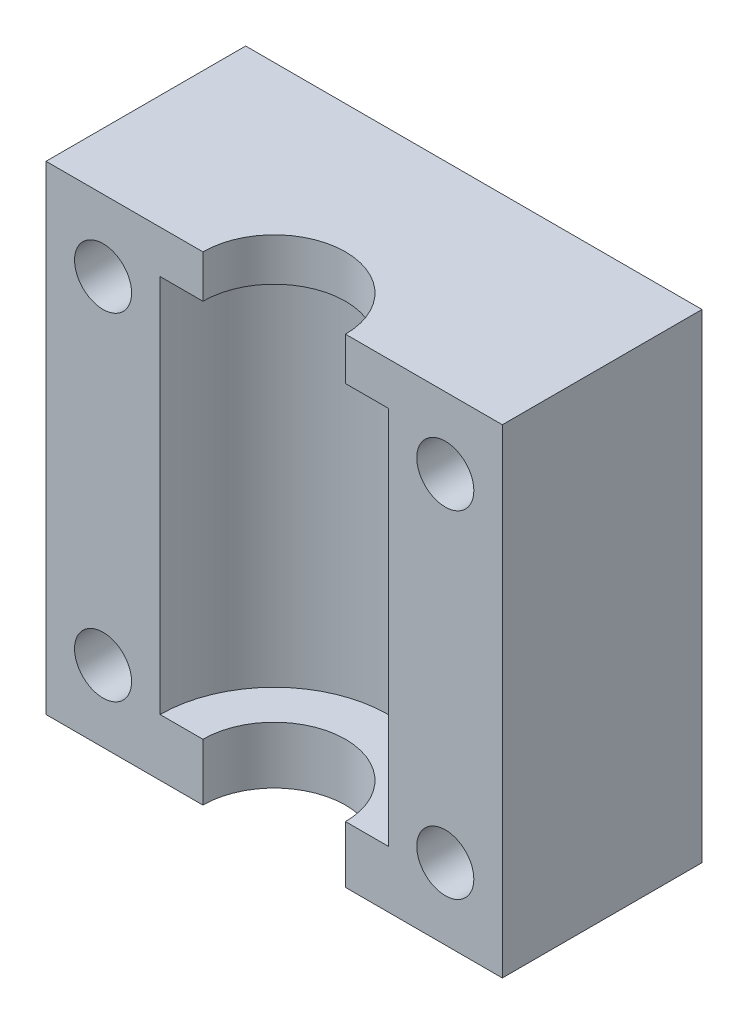
ISO-10303-21;
HEADER;
FILE_DESCRIPTION(('STEP AP214'),'2;1');
FILE_NAME('part.step','',(''),(''),'','','');
FILE_SCHEMA(('AUTOMOTIVE_DESIGN { 1 0 10303 214 1 1 1 1 }'));
ENDSEC;
DATA;
#1=APPLICATION_CONTEXT('core data for automotive mechanical design processes');
#2=APPLICATION_PROTOCOL_DEFINITION('international standard','automotive_design',2000,#1);
#3=PRODUCT_CONTEXT('',#1,'mechanical');
#4=PRODUCT('Part','Part','',(#3));
#5=PRODUCT_RELATED_PRODUCT_CATEGORY('part','',(#4));
#6=PRODUCT_DEFINITION_FORMATION('','',#4);
#7=PRODUCT_DEFINITION_CONTEXT('part definition',#1,'design');
#8=PRODUCT_DEFINITION('design','',#6,#7);
#9=PRODUCT_DEFINITION_SHAPE('','',#8);
#10=(LENGTH_UNIT() NAMED_UNIT(*) SI_UNIT(.MILLI.,.METRE.));
#11=(NAMED_UNIT(*) PLANE_ANGLE_UNIT() SI_UNIT($,.RADIAN.));
#12=(NAMED_UNIT(*) SI_UNIT($,.STERADIAN.) SOLID_ANGLE_UNIT());
#13=UNCERTAINTY_MEASURE_WITH_UNIT(LENGTH_MEASURE(1.E-05),#10,'distance_accuracy_value','');
#14=(GEOMETRIC_REPRESENTATION_CONTEXT(3) GLOBAL_UNCERTAINTY_ASSIGNED_CONTEXT((#13)) GLOBAL_UNIT_ASSIGNED_CONTEXT((#10,
#11,#12)) REPRESENTATION_CONTEXT('',''));
#15=CARTESIAN_POINT('',(0.,0.,0.));
#16=DIRECTION('',(0.,0.,1.));
#17=DIRECTION('',(1.,0.,0.));
#18=AXIS2_PLACEMENT_3D('',#15,#16,#17);
#19=CARTESIAN_POINT('',(0.,0.,0.));
#20=DIRECTION('',(0.,1.,0.));
#21=DIRECTION('',(-1.,0.,0.));
#22=AXIS2_PLACEMENT_3D('',#19,#20,#21);
#23=CYLINDRICAL_SURFACE('',#22,5.);
#24=CARTESIAN_POINT('',(0.,-30.6,0.));
#25=DIRECTION('',(0.,1.,0.));
#26=DIRECTION('',(-1.,0.,0.));
#27=AXIS2_PLACEMENT_3D('',#24,#25,#26);
#28=CIRCLE('',#27,5.);
#29=CARTESIAN_POINT('',(5.,-30.6,0.));
#30=VERTEX_POINT('',#29);
#31=CARTESIAN_POINT('',(-5.,-30.6,0.));
#32=VERTEX_POINT('',#31);
#33=EDGE_CURVE('E12',#30,#32,#28,.T.);
#34=ORIENTED_EDGE('',*,*,#33,.F.);
#35=DIRECTION('',(0.,1.,0.));
#36=VECTOR('',#35,1.);
#37=CARTESIAN_POINT('',(5.,-26.6,0.));
#38=LINE('',#37,#36);
#39=CARTESIAN_POINT('',(5.,-26.6,0.));
#40=VERTEX_POINT('',#39);
#41=EDGE_CURVE('E192',#30,#40,#38,.T.);
#42=ORIENTED_EDGE('',*,*,#41,.T.);
#43=CARTESIAN_POINT('',(0.,-26.6,0.));
#44=DIRECTION('',(0.,1.,0.));
#45=DIRECTION('',(-1.,0.,0.));
#46=AXIS2_PLACEMENT_3D('',#43,#44,#45);
#47=CIRCLE('',#46,5.);
#48=CARTESIAN_POINT('',(-5.,-26.6,0.));
#49=VERTEX_POINT('',#48);
#50=EDGE_CURVE('E209',#40,#49,#47,.T.);
#51=ORIENTED_EDGE('',*,*,#50,.T.);
#52=DIRECTION('',(0.,1.,0.));
#53=VECTOR('',#52,1.);
#54=CARTESIAN_POINT('',(-5.,-26.6,0.));
#55=LINE('',#54,#53);
#56=EDGE_CURVE('E143',#32,#49,#55,.T.);
#57=ORIENTED_EDGE('',*,*,#56,.F.);
#58=EDGE_LOOP('',(#34,#42,#51,#57));
#59=FACE_BOUND('',#58,.T.);
#60=ADVANCED_FACE('F57',(#59),#23,.F.);
#61=CARTESIAN_POINT('',(5.,-30.6,0.));
#62=DIRECTION('',(0.,-1.,0.));
#63=DIRECTION('',(1.,0.,0.));
#64=AXIS2_PLACEMENT_3D('',#61,#62,#63);
#65=PLANE('',#64);
#66=DIRECTION('',(1.,0.,0.));
#67=VECTOR('',#66,1.);
#68=CARTESIAN_POINT('',(0.,-30.6,-14.));
#69=LINE('',#68,#67);
#70=CARTESIAN_POINT('',(-16.,-30.6,-14.));
#71=VERTEX_POINT('',#70);
#72=CARTESIAN_POINT('',(16.,-30.6,-14.));
#73=VERTEX_POINT('',#72);
#74=EDGE_CURVE('E133',#71,#73,#69,.T.);
#75=ORIENTED_EDGE('',*,*,#74,.T.);
#76=DIRECTION('',(0.,0.,1.));
#77=VECTOR('',#76,1.);
#78=CARTESIAN_POINT('',(16.,-30.6,-14.));
#79=LINE('',#78,#77);
#80=CARTESIAN_POINT('',(16.,-30.6,0.));
#81=VERTEX_POINT('',#80);
#82=EDGE_CURVE('E135',#73,#81,#79,.T.);
#83=ORIENTED_EDGE('',*,*,#82,.T.);
#84=DIRECTION('',(-1.,0.,0.));
#85=VECTOR('',#84,1.);
#86=CARTESIAN_POINT('',(5.,-30.6,0.));
#87=LINE('',#86,#85);
#88=EDGE_CURVE('E73',#81,#30,#87,.T.);
#89=ORIENTED_EDGE('',*,*,#88,.T.);
#90=ORIENTED_EDGE('',*,*,#33,.T.);
#91=DIRECTION('',(1.,0.,0.));
#92=VECTOR('',#91,1.);
#93=CARTESIAN_POINT('',(-5.,-30.6,0.));
#94=LINE('',#93,#92);
#95=CARTESIAN_POINT('',(-16.,-30.6,0.));
#96=VERTEX_POINT('',#95);
#97=EDGE_CURVE('E190',#96,#32,#94,.T.);
#98=ORIENTED_EDGE('',*,*,#97,.F.);
#99=DIRECTION('',(0.,0.,1.));
#100=VECTOR('',#99,1.);
#101=CARTESIAN_POINT('',(-16.,-30.6,-14.));
#102=LINE('',#101,#100);
#103=EDGE_CURVE('E138',#71,#96,#102,.T.);
#104=ORIENTED_EDGE('',*,*,#103,.F.);
#105=EDGE_LOOP('',(#75,#83,#89,#90,#98,#104));
#106=FACE_BOUND('',#105,.T.);
#107=ADVANCED_FACE('F59',(#106),#65,.T.);
#108=CARTESIAN_POINT('',(5.,3.,0.));
#109=DIRECTION('',(0.,1.,0.));
#110=DIRECTION('',(-1.,0.,0.));
#111=AXIS2_PLACEMENT_3D('',#108,#109,#110);
#112=PLANE('',#111);
#113=DIRECTION('',(0.,0.,1.));
#114=VECTOR('',#113,1.);
#115=CARTESIAN_POINT('',(16.,3.00000000000001,-14.));
#116=LINE('',#115,#114);
#117=CARTESIAN_POINT('',(16.,3.00000000000001,-14.));
#118=VERTEX_POINT('',#117);
#119=CARTESIAN_POINT('',(16.,3.00000000000001,0.));
#120=VERTEX_POINT('',#119);
#121=EDGE_CURVE('E153',#118,#120,#116,.T.);
#122=ORIENTED_EDGE('',*,*,#121,.F.);
#123=DIRECTION('',(1.,0.,0.));
#124=VECTOR('',#123,1.);
#125=CARTESIAN_POINT('',(0.,3.,-14.));
#126=LINE('',#125,#124);
#127=CARTESIAN_POINT('',(-16.,3.,-14.));
#128=VERTEX_POINT('',#127);
#129=EDGE_CURVE('E144',#128,#118,#126,.T.);
#130=ORIENTED_EDGE('',*,*,#129,.F.);
#131=DIRECTION('',(0.,0.,1.));
#132=VECTOR('',#131,1.);
#133=CARTESIAN_POINT('',(-16.,3.,-14.));
#134=LINE('',#133,#132);
#135=CARTESIAN_POINT('',(-16.,3.,0.));
#136=VERTEX_POINT('',#135);
#137=EDGE_CURVE('E167',#128,#136,#134,.T.);
#138=ORIENTED_EDGE('',*,*,#137,.T.);
#139=DIRECTION('',(-1.,0.,0.));
#140=VECTOR('',#139,1.);
#141=CARTESIAN_POINT('',(-5.,3.,0.));
#142=LINE('',#141,#140);
#143=CARTESIAN_POINT('',(-5.,3.,0.));
#144=VERTEX_POINT('',#143);
#145=EDGE_CURVE('E188',#144,#136,#142,.T.);
#146=ORIENTED_EDGE('',*,*,#145,.F.);
#147=CARTESIAN_POINT('',(0.,3.,0.));
#148=DIRECTION('',(0.,1.,0.));
#149=DIRECTION('',(-1.,0.,0.));
#150=AXIS2_PLACEMENT_3D('',#147,#148,#149);
#151=CIRCLE('',#150,5.);
#152=CARTESIAN_POINT('',(5.,3.,0.));
#153=VERTEX_POINT('',#152);
#154=EDGE_CURVE('E66',#153,#144,#151,.T.);
#155=ORIENTED_EDGE('',*,*,#154,.F.);
#156=DIRECTION('',(1.,0.,0.));
#157=VECTOR('',#156,1.);
#158=CARTESIAN_POINT('',(5.,3.,0.));
#159=LINE('',#158,#157);
#160=EDGE_CURVE('E206',#153,#120,#159,.T.);
#161=ORIENTED_EDGE('',*,*,#160,.T.);
#162=EDGE_LOOP('',(#122,#130,#138,#146,#155,#161));
#163=FACE_BOUND('',#162,.T.);
#164=ADVANCED_FACE('F250',(#163),#112,.T.);
#165=CARTESIAN_POINT('',(0.,0.,0.));
#166=DIRECTION('',(0.,1.,0.));
#167=DIRECTION('',(-1.,0.,0.));
#168=AXIS2_PLACEMENT_3D('',#165,#166,#167);
#169=CYLINDRICAL_SURFACE('',#168,5.);
#170=CARTESIAN_POINT('',(0.,0.,0.));
#171=DIRECTION('',(0.,1.,0.));
#172=DIRECTION('',(-1.,0.,0.));
#173=AXIS2_PLACEMENT_3D('',#170,#171,#172);
#174=CIRCLE('',#173,5.);
#175=CARTESIAN_POINT('',(5.,0.,0.));
#176=VERTEX_POINT('',#175);
#177=CARTESIAN_POINT('',(-5.,0.,0.));
#178=VERTEX_POINT('',#177);
#179=EDGE_CURVE('E215',#176,#178,#174,.T.);
#180=ORIENTED_EDGE('',*,*,#179,.F.);
#181=DIRECTION('',(0.,1.,0.));
#182=VECTOR('',#181,1.);
#183=CARTESIAN_POINT('',(5.,0.,0.));
#184=LINE('',#183,#182);
#185=EDGE_CURVE('E204',#176,#153,#184,.T.);
#186=ORIENTED_EDGE('',*,*,#185,.T.);
#187=ORIENTED_EDGE('',*,*,#154,.T.);
#188=DIRECTION('',(0.,1.,0.));
#189=VECTOR('',#188,1.);
#190=CARTESIAN_POINT('',(-5.,0.,0.));
#191=LINE('',#190,#189);
#192=EDGE_CURVE('E185',#178,#144,#191,.T.);
#193=ORIENTED_EDGE('',*,*,#192,.F.);
#194=EDGE_LOOP('',(#180,#186,#187,#193));
#195=FACE_BOUND('',#194,.T.);
#196=ADVANCED_FACE('F266',(#195),#169,.F.);
#197=CARTESIAN_POINT('',(8.,0.,0.));
#198=DIRECTION('',(0.,-1.,0.));
#199=DIRECTION('',(1.,0.,0.));
#200=AXIS2_PLACEMENT_3D('',#197,#198,#199);
#201=PLANE('',#200);
#202=CARTESIAN_POINT('',(0.,0.,0.));
#203=DIRECTION('',(0.,1.,0.));
#204=DIRECTION('',(-1.,0.,0.));
#205=AXIS2_PLACEMENT_3D('',#202,#203,#204);
#206=CIRCLE('',#205,8.);
#207=CARTESIAN_POINT('',(8.,0.,0.));
#208=VERTEX_POINT('',#207);
#209=CARTESIAN_POINT('',(-8.,0.,0.));
#210=VERTEX_POINT('',#209);
#211=EDGE_CURVE('E213',#208,#210,#206,.T.);
#212=ORIENTED_EDGE('',*,*,#211,.F.);
#213=DIRECTION('',(-1.,0.,0.));
#214=VECTOR('',#213,1.);
#215=CARTESIAN_POINT('',(8.,0.,0.));
#216=LINE('',#215,#214);
#217=EDGE_CURVE('E201',#208,#176,#216,.T.);
#218=ORIENTED_EDGE('',*,*,#217,.T.);
#219=ORIENTED_EDGE('',*,*,#179,.T.);
#220=DIRECTION('',(1.,0.,0.));
#221=VECTOR('',#220,1.);
#222=CARTESIAN_POINT('',(-8.,0.,0.));
#223=LINE('',#222,#221);
#224=EDGE_CURVE('E182',#210,#178,#223,.T.);
#225=ORIENTED_EDGE('',*,*,#224,.F.);
#226=EDGE_LOOP('',(#212,#218,#219,#225));
#227=FACE_BOUND('',#226,.T.);
#228=ADVANCED_FACE('F262',(#227),#201,.T.);
#229=CARTESIAN_POINT('',(0.,0.,0.));
#230=DIRECTION('',(0.,1.,0.));
#231=DIRECTION('',(-1.,0.,0.));
#232=AXIS2_PLACEMENT_3D('',#229,#230,#231);
#233=CYLINDRICAL_SURFACE('',#232,8.);
#234=CARTESIAN_POINT('',(0.,-26.6,0.));
#235=DIRECTION('',(0.,1.,0.));
#236=DIRECTION('',(-1.,0.,0.));
#237=AXIS2_PLACEMENT_3D('',#234,#235,#236);
#238=CIRCLE('',#237,8.);
#239=CARTESIAN_POINT('',(8.,-26.6,0.));
#240=VERTEX_POINT('',#239);
#241=CARTESIAN_POINT('',(-8.,-26.6,0.));
#242=VERTEX_POINT('',#241);
#243=EDGE_CURVE('E211',#240,#242,#238,.T.);
#244=ORIENTED_EDGE('',*,*,#243,.F.);
#245=DIRECTION('',(0.,1.,0.));
#246=VECTOR('',#245,1.);
#247=CARTESIAN_POINT('',(8.,-26.6,0.));
#248=LINE('',#247,#246);
#249=EDGE_CURVE('E198',#240,#208,#248,.T.);
#250=ORIENTED_EDGE('',*,*,#249,.T.);
#251=ORIENTED_EDGE('',*,*,#211,.T.);
#252=DIRECTION('',(0.,1.,0.));
#253=VECTOR('',#252,1.);
#254=CARTESIAN_POINT('',(-8.,-26.6,0.));
#255=LINE('',#254,#253);
#256=EDGE_CURVE('E179',#242,#210,#255,.T.);
#257=ORIENTED_EDGE('',*,*,#256,.F.);
#258=EDGE_LOOP('',(#244,#250,#251,#257));
#259=FACE_BOUND('',#258,.T.);
#260=ADVANCED_FACE('F258',(#259),#233,.F.);
#261=CARTESIAN_POINT('',(8.,-26.6,0.));
#262=DIRECTION('',(0.,1.,0.));
#263=DIRECTION('',(-1.,0.,0.));
#264=AXIS2_PLACEMENT_3D('',#261,#262,#263);
#265=PLANE('',#264);
#266=DIRECTION('',(1.,0.,0.));
#267=VECTOR('',#266,1.);
#268=CARTESIAN_POINT('',(8.,-26.6,0.));
#269=LINE('',#268,#267);
#270=EDGE_CURVE('E195',#40,#240,#269,.T.);
#271=ORIENTED_EDGE('',*,*,#270,.T.);
#272=ORIENTED_EDGE('',*,*,#243,.T.);
#273=DIRECTION('',(-1.,0.,0.));
#274=VECTOR('',#273,1.);
#275=CARTESIAN_POINT('',(-8.,-26.6,0.));
#276=LINE('',#275,#274);
#277=EDGE_CURVE('E176',#49,#242,#276,.T.);
#278=ORIENTED_EDGE('',*,*,#277,.F.);
#279=ORIENTED_EDGE('',*,*,#50,.F.);
#280=EDGE_LOOP('',(#271,#272,#278,#279));
#281=FACE_BOUND('',#280,.T.);
#282=ADVANCED_FACE('F255',(#281),#265,.T.);
#283=CARTESIAN_POINT('',(0.,0.,0.));
#284=DIRECTION('',(0.,0.,1.));
#285=DIRECTION('',(1.,0.,0.));
#286=AXIS2_PLACEMENT_3D('',#283,#284,#285);
#287=PLANE('',#286);
#288=CARTESIAN_POINT('',(12.,-2.,0.));
#289=DIRECTION('',(0.,0.,1.));
#290=DIRECTION('',(1.,0.,0.));
#291=AXIS2_PLACEMENT_3D('',#288,#289,#290);
#292=CIRCLE('',#291,2.);
#293=CARTESIAN_POINT('',(14.,-2.,0.));
#294=VERTEX_POINT('',#293);
#295=EDGE_CURVE('E318',#294,#294,#292,.T.);
#296=ORIENTED_EDGE('',*,*,#295,.F.);
#297=EDGE_LOOP('',(#296));
#298=FACE_BOUND('',#297,.T.);
#299=CARTESIAN_POINT('',(12.,-25.6,0.));
#300=DIRECTION('',(0.,0.,1.));
#301=DIRECTION('',(1.,0.,0.));
#302=AXIS2_PLACEMENT_3D('',#299,#300,#301);
#303=CIRCLE('',#302,2.);
#304=CARTESIAN_POINT('',(14.,-25.6,0.));
#305=VERTEX_POINT('',#304);
#306=EDGE_CURVE('E323',#305,#305,#303,.T.);
#307=ORIENTED_EDGE('',*,*,#306,.F.);
#308=EDGE_LOOP('',(#307));
#309=FACE_BOUND('',#308,.T.);
#310=ORIENTED_EDGE('',*,*,#41,.F.);
#311=ORIENTED_EDGE('',*,*,#88,.F.);
#312=DIRECTION('',(0.,1.,0.));
#313=VECTOR('',#312,1.);
#314=CARTESIAN_POINT('',(16.,3.00000000000001,0.));
#315=LINE('',#314,#313);
#316=EDGE_CURVE('E152',#81,#120,#315,.T.);
#317=ORIENTED_EDGE('',*,*,#316,.T.);
#318=ORIENTED_EDGE('',*,*,#160,.F.);
#319=ORIENTED_EDGE('',*,*,#185,.F.);
#320=ORIENTED_EDGE('',*,*,#217,.F.);
#321=ORIENTED_EDGE('',*,*,#249,.F.);
#322=ORIENTED_EDGE('',*,*,#270,.F.);
#323=EDGE_LOOP('',(#310,#311,#317,#318,#319,#320,#321,#322));
#324=FACE_BOUND('',#323,.T.);
#325=ADVANCED_FACE('F253',(#298,#309,#324),#287,.T.);
#326=CARTESIAN_POINT('',(0.,0.,0.));
#327=DIRECTION('',(0.,0.,-1.));
#328=DIRECTION('',(-1.,0.,0.));
#329=AXIS2_PLACEMENT_3D('',#326,#327,#328);
#330=PLANE('',#329);
#331=CARTESIAN_POINT('',(-12.,-25.6,0.));
#332=DIRECTION('',(0.,0.,1.));
#333=DIRECTION('',(1.,0.,0.));
#334=AXIS2_PLACEMENT_3D('',#331,#332,#333);
#335=CIRCLE('',#334,2.);
#336=CARTESIAN_POINT('',(-10.,-25.6,0.));
#337=VERTEX_POINT('',#336);
#338=EDGE_CURVE('E319',#337,#337,#335,.T.);
#339=ORIENTED_EDGE('',*,*,#338,.F.);
#340=EDGE_LOOP('',(#339));
#341=FACE_BOUND('',#340,.T.);
#342=CARTESIAN_POINT('',(-12.,-2.,0.));
#343=DIRECTION('',(0.,0.,1.));
#344=DIRECTION('',(1.,0.,0.));
#345=AXIS2_PLACEMENT_3D('',#342,#343,#344);
#346=CIRCLE('',#345,2.);
#347=CARTESIAN_POINT('',(-10.,-2.,0.));
#348=VERTEX_POINT('',#347);
#349=EDGE_CURVE('E160',#348,#348,#346,.T.);
#350=ORIENTED_EDGE('',*,*,#349,.F.);
#351=EDGE_LOOP('',(#350));
#352=FACE_BOUND('',#351,.T.);
#353=ORIENTED_EDGE('',*,*,#277,.T.);
#354=ORIENTED_EDGE('',*,*,#256,.T.);
#355=ORIENTED_EDGE('',*,*,#224,.T.);
#356=ORIENTED_EDGE('',*,*,#192,.T.);
#357=ORIENTED_EDGE('',*,*,#145,.T.);
#358=DIRECTION('',(0.,-1.,0.));
#359=VECTOR('',#358,1.);
#360=CARTESIAN_POINT('',(-16.,3.,0.));
#361=LINE('',#360,#359);
#362=EDGE_CURVE('E163',#136,#96,#361,.T.);
#363=ORIENTED_EDGE('',*,*,#362,.T.);
#364=ORIENTED_EDGE('',*,*,#97,.T.);
#365=ORIENTED_EDGE('',*,*,#56,.T.);
#366=EDGE_LOOP('',(#353,#354,#355,#356,#357,#363,#364,#365));
#367=FACE_BOUND('',#366,.T.);
#368=ADVANCED_FACE('F286',(#341,#352,#367),#330,.F.);
#369=CARTESIAN_POINT('',(0.,-30.6,-14.));
#370=DIRECTION('',(0.,0.,1.));
#371=DIRECTION('',(1.,0.,0.));
#372=AXIS2_PLACEMENT_3D('',#369,#370,#371);
#373=PLANE('',#372);
#374=CARTESIAN_POINT('',(12.,-2.,-14.));
#375=DIRECTION('',(0.,0.,1.));
#376=DIRECTION('',(1.,0.,0.));
#377=AXIS2_PLACEMENT_3D('',#374,#375,#376);
#378=CIRCLE('',#377,2.);
#379=CARTESIAN_POINT('',(14.,-2.,-14.));
#380=VERTEX_POINT('',#379);
#381=EDGE_CURVE('E61',#380,#380,#378,.T.);
#382=ORIENTED_EDGE('',*,*,#381,.T.);
#383=EDGE_LOOP('',(#382));
#384=FACE_BOUND('',#383,.T.);
#385=CARTESIAN_POINT('',(-12.,-25.6,-14.));
#386=DIRECTION('',(0.,0.,1.));
#387=DIRECTION('',(1.,0.,0.));
#388=AXIS2_PLACEMENT_3D('',#385,#386,#387);
#389=CIRCLE('',#388,2.);
#390=CARTESIAN_POINT('',(-10.,-25.6,-14.));
#391=VERTEX_POINT('',#390);
#392=EDGE_CURVE('E223',#391,#391,#389,.T.);
#393=ORIENTED_EDGE('',*,*,#392,.T.);
#394=EDGE_LOOP('',(#393));
#395=FACE_BOUND('',#394,.T.);
#396=CARTESIAN_POINT('',(12.,-25.6,-14.));
#397=DIRECTION('',(0.,0.,1.));
#398=DIRECTION('',(1.,0.,0.));
#399=AXIS2_PLACEMENT_3D('',#396,#397,#398);
#400=CIRCLE('',#399,2.);
#401=CARTESIAN_POINT('',(14.,-25.6,-14.));
#402=VERTEX_POINT('',#401);
#403=EDGE_CURVE('E221',#402,#402,#400,.T.);
#404=ORIENTED_EDGE('',*,*,#403,.T.);
#405=EDGE_LOOP('',(#404));
#406=FACE_BOUND('',#405,.T.);
#407=CARTESIAN_POINT('',(-12.,-2.,-14.));
#408=DIRECTION('',(0.,0.,1.));
#409=DIRECTION('',(1.,0.,0.));
#410=AXIS2_PLACEMENT_3D('',#407,#408,#409);
#411=CIRCLE('',#410,2.);
#412=CARTESIAN_POINT('',(-10.,-2.,-14.));
#413=VERTEX_POINT('',#412);
#414=EDGE_CURVE('E218',#413,#413,#411,.T.);
#415=ORIENTED_EDGE('',*,*,#414,.T.);
#416=EDGE_LOOP('',(#415));
#417=FACE_BOUND('',#416,.T.);
#418=ORIENTED_EDGE('',*,*,#129,.T.);
#419=DIRECTION('',(0.,1.,0.));
#420=VECTOR('',#419,1.);
#421=CARTESIAN_POINT('',(16.,3.00000000000001,-14.));
#422=LINE('',#421,#420);
#423=EDGE_CURVE('E150',#73,#118,#422,.T.);
#424=ORIENTED_EDGE('',*,*,#423,.F.);
#425=ORIENTED_EDGE('',*,*,#74,.F.);
#426=DIRECTION('',(0.,-1.,0.));
#427=VECTOR('',#426,1.);
#428=CARTESIAN_POINT('',(-16.,3.,-14.));
#429=LINE('',#428,#427);
#430=EDGE_CURVE('E165',#128,#71,#429,.T.);
#431=ORIENTED_EDGE('',*,*,#430,.F.);
#432=EDGE_LOOP('',(#418,#424,#425,#431));
#433=FACE_BOUND('',#432,.T.);
#434=ADVANCED_FACE('F155',(#384,#395,#406,#417,#433),#373,.F.);
#435=CARTESIAN_POINT('',(-16.,3.,-14.));
#436=DIRECTION('',(-1.,0.,0.));
#437=DIRECTION('',(0.,-1.,0.));
#438=AXIS2_PLACEMENT_3D('',#435,#436,#437);
#439=PLANE('',#438);
#440=ORIENTED_EDGE('',*,*,#362,.F.);
#441=ORIENTED_EDGE('',*,*,#137,.F.);
#442=ORIENTED_EDGE('',*,*,#430,.T.);
#443=ORIENTED_EDGE('',*,*,#103,.T.);
#444=EDGE_LOOP('',(#440,#441,#442,#443));
#445=FACE_BOUND('',#444,.T.);
#446=ADVANCED_FACE('F285',(#445),#439,.T.);
#447=CARTESIAN_POINT('',(16.,3.00000000000001,-14.));
#448=DIRECTION('',(1.,0.,0.));
#449=DIRECTION('',(0.,1.,0.));
#450=AXIS2_PLACEMENT_3D('',#447,#448,#449);
#451=PLANE('',#450);
#452=ORIENTED_EDGE('',*,*,#316,.F.);
#453=ORIENTED_EDGE('',*,*,#82,.F.);
#454=ORIENTED_EDGE('',*,*,#423,.T.);
#455=ORIENTED_EDGE('',*,*,#121,.T.);
#456=EDGE_LOOP('',(#452,#453,#454,#455));
#457=FACE_BOUND('',#456,.T.);
#458=ADVANCED_FACE('F148',(#457),#451,.T.);
#459=CARTESIAN_POINT('',(-12.,-2.,-26.));
#460=DIRECTION('',(0.,0.,1.));
#461=DIRECTION('',(1.,0.,0.));
#462=AXIS2_PLACEMENT_3D('',#459,#460,#461);
#463=CYLINDRICAL_SURFACE('',#462,2.);
#464=ORIENTED_EDGE('',*,*,#349,.T.);
#465=EDGE_LOOP('',(#464));
#466=FACE_BOUND('',#465,.T.);
#467=ORIENTED_EDGE('',*,*,#414,.F.);
#468=EDGE_LOOP('',(#467));
#469=FACE_BOUND('',#468,.T.);
#470=ADVANCED_FACE('F306',(#466,#469),#463,.F.);
#471=CARTESIAN_POINT('',(12.,-25.6,-26.));
#472=DIRECTION('',(0.,0.,1.));
#473=DIRECTION('',(1.,0.,0.));
#474=AXIS2_PLACEMENT_3D('',#471,#472,#473);
#475=CYLINDRICAL_SURFACE('',#474,2.);
#476=ORIENTED_EDGE('',*,*,#306,.T.);
#477=EDGE_LOOP('',(#476));
#478=FACE_BOUND('',#477,.T.);
#479=ORIENTED_EDGE('',*,*,#403,.F.);
#480=EDGE_LOOP('',(#479));
#481=FACE_BOUND('',#480,.T.);
#482=ADVANCED_FACE('F239',(#478,#481),#475,.F.);
#483=CARTESIAN_POINT('',(-12.,-25.6,-26.));
#484=DIRECTION('',(0.,0.,1.));
#485=DIRECTION('',(1.,0.,0.));
#486=AXIS2_PLACEMENT_3D('',#483,#484,#485);
#487=CYLINDRICAL_SURFACE('',#486,2.);
#488=ORIENTED_EDGE('',*,*,#338,.T.);
#489=EDGE_LOOP('',(#488));
#490=FACE_BOUND('',#489,.T.);
#491=ORIENTED_EDGE('',*,*,#392,.F.);
#492=EDGE_LOOP('',(#491));
#493=FACE_BOUND('',#492,.T.);
#494=ADVANCED_FACE('F233',(#490,#493),#487,.F.);
#495=CARTESIAN_POINT('',(12.,-2.,-26.));
#496=DIRECTION('',(0.,0.,1.));
#497=DIRECTION('',(1.,0.,0.));
#498=AXIS2_PLACEMENT_3D('',#495,#496,#497);
#499=CYLINDRICAL_SURFACE('',#498,2.);
#500=ORIENTED_EDGE('',*,*,#295,.T.);
#501=EDGE_LOOP('',(#500));
#502=FACE_BOUND('',#501,.T.);
#503=ORIENTED_EDGE('',*,*,#381,.F.);
#504=EDGE_LOOP('',(#503));
#505=FACE_BOUND('',#504,.T.);
#506=ADVANCED_FACE('F231',(#502,#505),#499,.F.);
#507=CLOSED_SHELL('',(#60,#107,#164,#196,#228,#260,#282,#325,#368,#434,#446,#458,#470,#482,#494,#506));
#508=MANIFOLD_SOLID_BREP('B2',#507);
#509=ADVANCED_BREP_SHAPE_REPRESENTATION('',(#18,#508),#14);
#510=SHAPE_DEFINITION_REPRESENTATION(#9,#509);
ENDSEC;
END-ISO-10303-21;
